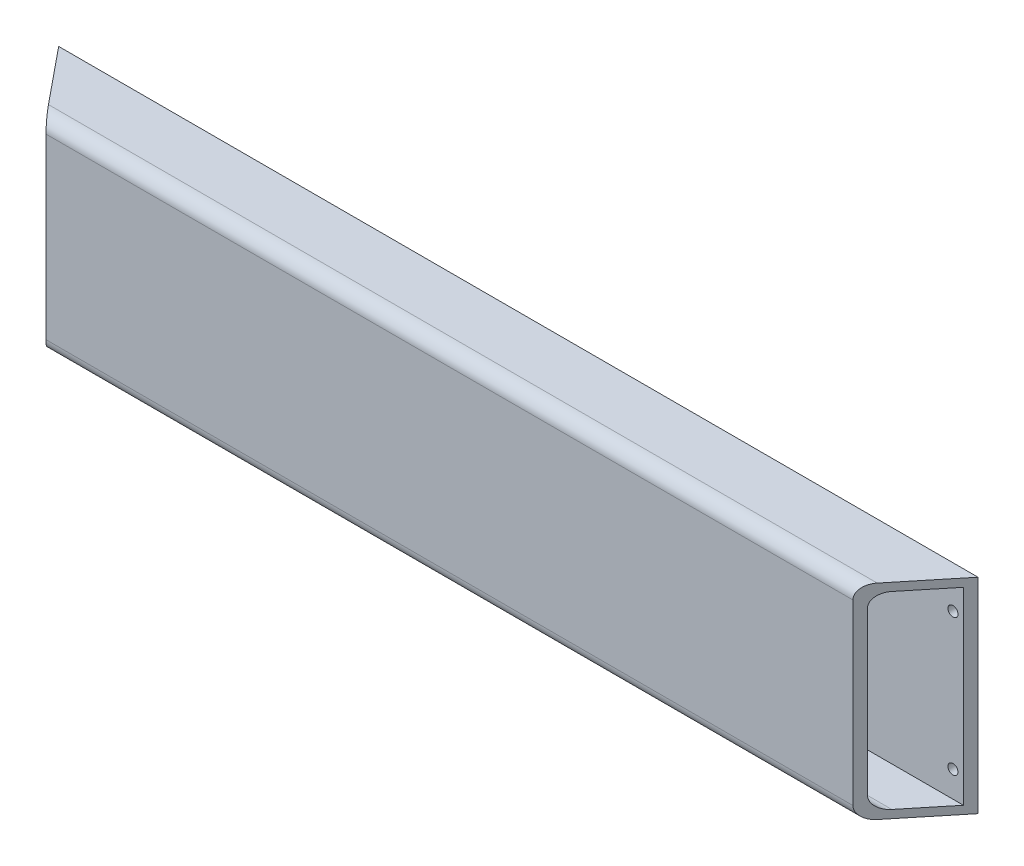
ISO-10303-21;
HEADER;
FILE_DESCRIPTION(('STEP AP214'),'2;1');
FILE_NAME('part.step','',(''),(''),'','','');
FILE_SCHEMA(('AUTOMOTIVE_DESIGN { 1 0 10303 214 1 1 1 1 }'));
ENDSEC;
DATA;
#1=APPLICATION_CONTEXT('core data for automotive mechanical design processes');
#2=APPLICATION_PROTOCOL_DEFINITION('international standard','automotive_design',2000,#1);
#3=PRODUCT_CONTEXT('',#1,'mechanical');
#4=PRODUCT('Part','Part','',(#3));
#5=PRODUCT_RELATED_PRODUCT_CATEGORY('part','',(#4));
#6=PRODUCT_DEFINITION_FORMATION('','',#4);
#7=PRODUCT_DEFINITION_CONTEXT('part definition',#1,'design');
#8=PRODUCT_DEFINITION('design','',#6,#7);
#9=PRODUCT_DEFINITION_SHAPE('','',#8);
#10=(LENGTH_UNIT() NAMED_UNIT(*) SI_UNIT(.MILLI.,.METRE.));
#11=(NAMED_UNIT(*) PLANE_ANGLE_UNIT() SI_UNIT($,.RADIAN.));
#12=(NAMED_UNIT(*) SI_UNIT($,.STERADIAN.) SOLID_ANGLE_UNIT());
#13=UNCERTAINTY_MEASURE_WITH_UNIT(LENGTH_MEASURE(1.E-05),#10,'distance_accuracy_value','');
#14=(GEOMETRIC_REPRESENTATION_CONTEXT(3) GLOBAL_UNCERTAINTY_ASSIGNED_CONTEXT((#13)) GLOBAL_UNIT_ASSIGNED_CONTEXT((#10,
#11,#12)) REPRESENTATION_CONTEXT('',''));
#15=CARTESIAN_POINT('',(0.,0.,0.));
#16=DIRECTION('',(0.,0.,1.));
#17=DIRECTION('',(1.,0.,0.));
#18=AXIS2_PLACEMENT_3D('',#15,#16,#17);
#19=CARTESIAN_POINT('',(0.,442.835896575332,0.));
#20=DIRECTION('',(0.774721400889097,0.,-0.632302736831366));
#21=DIRECTION('',(-0.632302736831366,0.,-0.774721400889097));
#22=AXIS2_PLACEMENT_3D('',#19,#20,#21);
#23=PLANE('',#22);
#24=DIRECTION('',(0.632302736831365,0.,0.774721400889097));
#25=VECTOR('',#24,1.);
#26=CARTESIAN_POINT('',(0.,0.,0.));
#27=LINE('',#26,#25);
#28=CARTESIAN_POINT('',(0.,0.,0.));
#29=VERTEX_POINT('',#28);
#30=CARTESIAN_POINT('',(33.8383210260396,0.,41.46));
#31=VERTEX_POINT('',#30);
#32=EDGE_CURVE('E166',#29,#31,#27,.T.);
#33=ORIENTED_EDGE('',*,*,#32,.T.);
#34=CARTESIAN_POINT('',(33.8383210260396,10.,41.46));
#35=DIRECTION('',(0.774721400889097,0.,-0.632302736831366));
#36=DIRECTION('',(0.632302736831366,0.,0.774721400889097));
#37=AXIS2_PLACEMENT_3D('',#34,#35,#36);
#38=ELLIPSE('',#37,12.9078659612651,10.);
#39=CARTESIAN_POINT('',(42.,10.,51.46));
#40=VERTEX_POINT('',#39);
#41=EDGE_CURVE('E202',#31,#40,#38,.F.);
#42=ORIENTED_EDGE('',*,*,#41,.T.);
#43=DIRECTION('',(0.,-1.,0.));
#44=VECTOR('',#43,1.);
#45=CARTESIAN_POINT('',(42.,442.835896575332,51.46));
#46=LINE('',#45,#44);
#47=CARTESIAN_POINT('',(42.,143.,51.46));
#48=VERTEX_POINT('',#47);
#49=EDGE_CURVE('E173',#48,#40,#46,.T.);
#50=ORIENTED_EDGE('',*,*,#49,.F.);
#51=CARTESIAN_POINT('',(33.8383210260396,143.,41.46));
#52=DIRECTION('',(0.774721400889097,0.,-0.632302736831366));
#53=DIRECTION('',(-0.632302736831366,0.,-0.774721400889097));
#54=AXIS2_PLACEMENT_3D('',#51,#52,#53);
#55=ELLIPSE('',#54,12.9078659612651,10.);
#56=CARTESIAN_POINT('',(33.8383210260396,153.,41.46));
#57=VERTEX_POINT('',#56);
#58=EDGE_CURVE('E200',#48,#57,#55,.F.);
#59=ORIENTED_EDGE('',*,*,#58,.T.);
#60=DIRECTION('',(-0.632302736831366,0.,-0.774721400889097));
#61=VECTOR('',#60,1.);
#62=CARTESIAN_POINT('',(0.,153.,0.));
#63=LINE('',#62,#61);
#64=CARTESIAN_POINT('',(0.,153.,0.));
#65=VERTEX_POINT('',#64);
#66=EDGE_CURVE('E176',#57,#65,#63,.T.);
#67=ORIENTED_EDGE('',*,*,#66,.T.);
#68=DIRECTION('',(0.,-1.,0.));
#69=VECTOR('',#68,1.);
#70=CARTESIAN_POINT('',(0.,0.,0.));
#71=LINE('',#70,#69);
#72=EDGE_CURVE('E178',#65,#29,#71,.T.);
#73=ORIENTED_EDGE('',*,*,#72,.T.);
#74=EDGE_LOOP('',(#33,#42,#50,#59,#67,#73));
#75=FACE_BOUND('',#74,.T.);
#76=DIRECTION('',(-0.632302736831366,0.,-0.774721400889097));
#77=VECTOR('',#76,1.);
#78=CARTESIAN_POINT('',(0.,147.,0.));
#79=LINE('',#78,#77);
#80=CARTESIAN_POINT('',(28.9413136416634,147.,35.46));
#81=VERTEX_POINT('',#80);
#82=CARTESIAN_POINT('',(4.89700738437621,147.,6.));
#83=VERTEX_POINT('',#82);
#84=EDGE_CURVE('E144',#81,#83,#79,.T.);
#85=ORIENTED_EDGE('',*,*,#84,.F.);
#86=CARTESIAN_POINT('',(28.9413136416634,137.,35.46));
#87=DIRECTION('',(0.774721400889097,0.,-0.632302736831366));
#88=DIRECTION('',(0.632302736831366,0.,0.774721400889097));
#89=AXIS2_PLACEMENT_3D('',#86,#87,#88);
#90=ELLIPSE('',#89,12.9078659612651,10.);
#91=CARTESIAN_POINT('',(37.1029926156238,137.,45.46));
#92=VERTEX_POINT('',#91);
#93=EDGE_CURVE('E42',#81,#92,#90,.T.);
#94=ORIENTED_EDGE('',*,*,#93,.T.);
#95=DIRECTION('',(0.,-1.,0.));
#96=VECTOR('',#95,1.);
#97=CARTESIAN_POINT('',(37.1029926156238,0.,45.46));
#98=LINE('',#97,#96);
#99=CARTESIAN_POINT('',(37.1029926156238,16.,45.46));
#100=VERTEX_POINT('',#99);
#101=EDGE_CURVE('E153',#92,#100,#98,.T.);
#102=ORIENTED_EDGE('',*,*,#101,.T.);
#103=CARTESIAN_POINT('',(28.9413136416634,16.,35.46));
#104=DIRECTION('',(0.774721400889097,0.,-0.632302736831366));
#105=DIRECTION('',(-0.632302736831366,0.,-0.774721400889097));
#106=AXIS2_PLACEMENT_3D('',#103,#104,#105);
#107=ELLIPSE('',#106,12.9078659612651,10.);
#108=CARTESIAN_POINT('',(28.9413136416634,6.00000000000001,35.46));
#109=VERTEX_POINT('',#108);
#110=EDGE_CURVE('E49',#100,#109,#107,.T.);
#111=ORIENTED_EDGE('',*,*,#110,.T.);
#112=DIRECTION('',(0.632302736831366,0.,0.774721400889097));
#113=VECTOR('',#112,1.);
#114=CARTESIAN_POINT('',(0.,6.00000000000001,0.));
#115=LINE('',#114,#113);
#116=CARTESIAN_POINT('',(4.89700738437621,6.,6.));
#117=VERTEX_POINT('',#116);
#118=EDGE_CURVE('E150',#117,#109,#115,.T.);
#119=ORIENTED_EDGE('',*,*,#118,.F.);
#120=DIRECTION('',(0.,-1.,0.));
#121=VECTOR('',#120,1.);
#122=CARTESIAN_POINT('',(4.89700738437621,0.,6.));
#123=LINE('',#122,#121);
#124=EDGE_CURVE('E161',#83,#117,#123,.T.);
#125=ORIENTED_EDGE('',*,*,#124,.F.);
#126=EDGE_LOOP('',(#85,#94,#102,#111,#119,#125));
#127=FACE_BOUND('',#126,.T.);
#128=ADVANCED_FACE('F34',(#75,#127),#23,.F.);
#129=CARTESIAN_POINT('',(686.81,442.835896575332,0.));
#130=DIRECTION('',(-0.774721400889097,0.,-0.632302736831366));
#131=DIRECTION('',(-0.632302736831366,0.,0.774721400889097));
#132=AXIS2_PLACEMENT_3D('',#129,#130,#131);
#133=PLANE('',#132);
#134=DIRECTION('',(0.,-1.,0.));
#135=VECTOR('',#134,1.);
#136=CARTESIAN_POINT('',(644.81,442.835896575332,51.46));
#137=LINE('',#136,#135);
#138=CARTESIAN_POINT('',(644.81,143.,51.46));
#139=VERTEX_POINT('',#138);
#140=CARTESIAN_POINT('',(644.81,10.,51.46));
#141=VERTEX_POINT('',#140);
#142=EDGE_CURVE('E167',#139,#141,#137,.T.);
#143=ORIENTED_EDGE('',*,*,#142,.T.);
#144=CARTESIAN_POINT('',(652.97167897396,10.,41.46));
#145=DIRECTION('',(-0.774721400889097,0.,-0.632302736831366));
#146=DIRECTION('',(0.632302736831366,0.,-0.774721400889097));
#147=AXIS2_PLACEMENT_3D('',#144,#145,#146);
#148=ELLIPSE('',#147,12.9078659612651,10.);
#149=CARTESIAN_POINT('',(652.97167897396,0.,41.46));
#150=VERTEX_POINT('',#149);
#151=EDGE_CURVE('E196',#141,#150,#148,.F.);
#152=ORIENTED_EDGE('',*,*,#151,.T.);
#153=DIRECTION('',(0.632302736831366,0.,-0.774721400889097));
#154=VECTOR('',#153,1.);
#155=CARTESIAN_POINT('',(686.81,0.,0.));
#156=LINE('',#155,#154);
#157=CARTESIAN_POINT('',(686.81,0.,0.));
#158=VERTEX_POINT('',#157);
#159=EDGE_CURVE('E145',#150,#158,#156,.T.);
#160=ORIENTED_EDGE('',*,*,#159,.T.);
#161=DIRECTION('',(0.,1.,0.));
#162=VECTOR('',#161,1.);
#163=CARTESIAN_POINT('',(686.81,0.,0.));
#164=LINE('',#163,#162);
#165=CARTESIAN_POINT('',(686.81,153.,0.));
#166=VERTEX_POINT('',#165);
#167=EDGE_CURVE('E183',#158,#166,#164,.T.);
#168=ORIENTED_EDGE('',*,*,#167,.T.);
#169=DIRECTION('',(-0.632302736831366,0.,0.774721400889097));
#170=VECTOR('',#169,1.);
#171=CARTESIAN_POINT('',(686.81,153.,0.));
#172=LINE('',#171,#170);
#173=CARTESIAN_POINT('',(652.97167897396,153.,41.46));
#174=VERTEX_POINT('',#173);
#175=EDGE_CURVE('E163',#166,#174,#172,.T.);
#176=ORIENTED_EDGE('',*,*,#175,.T.);
#177=CARTESIAN_POINT('',(652.97167897396,143.,41.46));
#178=DIRECTION('',(-0.774721400889097,0.,-0.632302736831366));
#179=DIRECTION('',(-0.632302736831366,0.,0.774721400889097));
#180=AXIS2_PLACEMENT_3D('',#177,#178,#179);
#181=ELLIPSE('',#180,12.9078659612651,10.);
#182=EDGE_CURVE('E194',#174,#139,#181,.F.);
#183=ORIENTED_EDGE('',*,*,#182,.T.);
#184=EDGE_LOOP('',(#143,#152,#160,#168,#176,#183));
#185=FACE_BOUND('',#184,.T.);
#186=DIRECTION('',(-0.632302736831366,0.,0.774721400889097));
#187=VECTOR('',#186,1.);
#188=CARTESIAN_POINT('',(686.81,147.,0.));
#189=LINE('',#188,#187);
#190=CARTESIAN_POINT('',(681.912992615624,147.,6.));
#191=VERTEX_POINT('',#190);
#192=CARTESIAN_POINT('',(657.868686358337,147.,35.46));
#193=VERTEX_POINT('',#192);
#194=EDGE_CURVE('E141',#191,#193,#189,.T.);
#195=ORIENTED_EDGE('',*,*,#194,.F.);
#196=DIRECTION('',(0.,1.,0.));
#197=VECTOR('',#196,1.);
#198=CARTESIAN_POINT('',(681.912992615624,0.,6.));
#199=LINE('',#198,#197);
#200=CARTESIAN_POINT('',(681.912992615624,6.,6.));
#201=VERTEX_POINT('',#200);
#202=EDGE_CURVE('E126',#201,#191,#199,.T.);
#203=ORIENTED_EDGE('',*,*,#202,.F.);
#204=DIRECTION('',(0.632302736831366,0.,-0.774721400889097));
#205=VECTOR('',#204,1.);
#206=CARTESIAN_POINT('',(686.81,6.00000000000001,0.));
#207=LINE('',#206,#205);
#208=CARTESIAN_POINT('',(657.868686358337,6.00000000000001,35.46));
#209=VERTEX_POINT('',#208);
#210=EDGE_CURVE('E155',#209,#201,#207,.T.);
#211=ORIENTED_EDGE('',*,*,#210,.F.);
#212=CARTESIAN_POINT('',(657.868686358336,16.,35.46));
#213=DIRECTION('',(-0.774721400889097,0.,-0.632302736831366));
#214=DIRECTION('',(-0.632302736831366,0.,0.774721400889097));
#215=AXIS2_PLACEMENT_3D('',#212,#213,#214);
#216=ELLIPSE('',#215,12.9078659612651,10.);
#217=CARTESIAN_POINT('',(649.707007384376,16.,45.46));
#218=VERTEX_POINT('',#217);
#219=EDGE_CURVE('E214',#209,#218,#216,.T.);
#220=ORIENTED_EDGE('',*,*,#219,.T.);
#221=DIRECTION('',(0.,-1.,0.));
#222=VECTOR('',#221,1.);
#223=CARTESIAN_POINT('',(649.707007384376,442.835896575332,45.46));
#224=LINE('',#223,#222);
#225=CARTESIAN_POINT('',(649.707007384376,137.,45.46));
#226=VERTEX_POINT('',#225);
#227=EDGE_CURVE('E151',#226,#218,#224,.T.);
#228=ORIENTED_EDGE('',*,*,#227,.F.);
#229=CARTESIAN_POINT('',(657.868686358336,137.,35.46));
#230=DIRECTION('',(-0.774721400889097,0.,-0.632302736831366));
#231=DIRECTION('',(0.632302736831366,0.,-0.774721400889097));
#232=AXIS2_PLACEMENT_3D('',#229,#230,#231);
#233=ELLIPSE('',#232,12.9078659612651,10.);
#234=EDGE_CURVE('E11',#226,#193,#233,.T.);
#235=ORIENTED_EDGE('',*,*,#234,.T.);
#236=EDGE_LOOP('',(#195,#203,#211,#220,#228,#235));
#237=FACE_BOUND('',#236,.T.);
#238=ADVANCED_FACE('F147',(#185,#237),#133,.F.);
#239=CARTESIAN_POINT('',(0.,0.,51.46));
#240=DIRECTION('',(0.,1.,0.));
#241=DIRECTION('',(0.,0.,1.));
#242=AXIS2_PLACEMENT_3D('',#239,#240,#241);
#243=PLANE('',#242);
#244=ORIENTED_EDGE('',*,*,#159,.F.);
#245=DIRECTION('',(1.,0.,0.));
#246=VECTOR('',#245,1.);
#247=CARTESIAN_POINT('',(0.,0.,41.46));
#248=LINE('',#247,#246);
#249=EDGE_CURVE('E198',#150,#31,#248,.F.);
#250=ORIENTED_EDGE('',*,*,#249,.T.);
#251=ORIENTED_EDGE('',*,*,#32,.F.);
#252=DIRECTION('',(1.,0.,0.));
#253=VECTOR('',#252,1.);
#254=CARTESIAN_POINT('',(0.,0.,0.));
#255=LINE('',#254,#253);
#256=EDGE_CURVE('E180',#29,#158,#255,.T.);
#257=ORIENTED_EDGE('',*,*,#256,.T.);
#258=EDGE_LOOP('',(#244,#250,#251,#257));
#259=FACE_BOUND('',#258,.T.);
#260=ADVANCED_FACE('F232',(#259),#243,.F.);
#261=CARTESIAN_POINT('',(0.,153.,51.46));
#262=DIRECTION('',(0.,-1.,0.));
#263=DIRECTION('',(0.,0.,-1.));
#264=AXIS2_PLACEMENT_3D('',#261,#262,#263);
#265=PLANE('',#264);
#266=ORIENTED_EDGE('',*,*,#66,.F.);
#267=DIRECTION('',(-1.,0.,0.));
#268=VECTOR('',#267,1.);
#269=CARTESIAN_POINT('',(0.,153.,41.46));
#270=LINE('',#269,#268);
#271=EDGE_CURVE('E204',#57,#174,#270,.F.);
#272=ORIENTED_EDGE('',*,*,#271,.T.);
#273=ORIENTED_EDGE('',*,*,#175,.F.);
#274=DIRECTION('',(-1.,0.,0.));
#275=VECTOR('',#274,1.);
#276=CARTESIAN_POINT('',(0.,153.,0.));
#277=LINE('',#276,#275);
#278=EDGE_CURVE('E185',#166,#65,#277,.T.);
#279=ORIENTED_EDGE('',*,*,#278,.T.);
#280=EDGE_LOOP('',(#266,#272,#273,#279));
#281=FACE_BOUND('',#280,.T.);
#282=ADVANCED_FACE('F241',(#281),#265,.F.);
#283=CARTESIAN_POINT('',(0.,0.,51.46));
#284=DIRECTION('',(0.,0.,-1.));
#285=DIRECTION('',(-1.,0.,0.));
#286=AXIS2_PLACEMENT_3D('',#283,#284,#285);
#287=PLANE('',#286);
#288=ORIENTED_EDGE('',*,*,#49,.T.);
#289=DIRECTION('',(1.,0.,0.));
#290=VECTOR('',#289,1.);
#291=CARTESIAN_POINT('',(0.,10.,51.46));
#292=LINE('',#291,#290);
#293=EDGE_CURVE('E191',#40,#141,#292,.T.);
#294=ORIENTED_EDGE('',*,*,#293,.T.);
#295=ORIENTED_EDGE('',*,*,#142,.F.);
#296=DIRECTION('',(-1.,0.,0.));
#297=VECTOR('',#296,1.);
#298=CARTESIAN_POINT('',(0.,143.,51.46));
#299=LINE('',#298,#297);
#300=EDGE_CURVE('E188',#139,#48,#299,.T.);
#301=ORIENTED_EDGE('',*,*,#300,.T.);
#302=EDGE_LOOP('',(#288,#294,#295,#301));
#303=FACE_BOUND('',#302,.T.);
#304=ADVANCED_FACE('F237',(#303),#287,.F.);
#305=CARTESIAN_POINT('',(0.,0.,0.));
#306=DIRECTION('',(0.,0.,-1.));
#307=DIRECTION('',(-1.,0.,0.));
#308=AXIS2_PLACEMENT_3D('',#305,#306,#307);
#309=PLANE('',#308);
#310=CARTESIAN_POINT('',(12.7,127.6,0.));
#311=DIRECTION('',(0.,0.,-1.));
#312=DIRECTION('',(-1.,0.,0.));
#313=AXIS2_PLACEMENT_3D('',#310,#311,#312);
#314=CIRCLE('',#313,3.75);
#315=CARTESIAN_POINT('',(8.95,127.6,0.));
#316=VERTEX_POINT('',#315);
#317=EDGE_CURVE('E414',#316,#316,#314,.F.);
#318=ORIENTED_EDGE('',*,*,#317,.T.);
#319=EDGE_LOOP('',(#318));
#320=FACE_BOUND('',#319,.T.);
#321=CARTESIAN_POINT('',(674.11,25.4,0.));
#322=DIRECTION('',(0.,0.,-1.));
#323=DIRECTION('',(-1.,0.,0.));
#324=AXIS2_PLACEMENT_3D('',#321,#322,#323);
#325=CIRCLE('',#324,3.74999999999998);
#326=CARTESIAN_POINT('',(670.36,25.4,0.));
#327=VERTEX_POINT('',#326);
#328=EDGE_CURVE('E422',#327,#327,#325,.F.);
#329=ORIENTED_EDGE('',*,*,#328,.T.);
#330=EDGE_LOOP('',(#329));
#331=FACE_BOUND('',#330,.T.);
#332=CARTESIAN_POINT('',(674.11,127.6,0.));
#333=DIRECTION('',(0.,0.,-1.));
#334=DIRECTION('',(-1.,0.,0.));
#335=AXIS2_PLACEMENT_3D('',#332,#333,#334);
#336=CIRCLE('',#335,3.74999999999998);
#337=CARTESIAN_POINT('',(670.36,127.6,0.));
#338=VERTEX_POINT('',#337);
#339=EDGE_CURVE('E415',#338,#338,#336,.F.);
#340=ORIENTED_EDGE('',*,*,#339,.T.);
#341=EDGE_LOOP('',(#340));
#342=FACE_BOUND('',#341,.T.);
#343=CARTESIAN_POINT('',(12.7,25.4,0.));
#344=DIRECTION('',(0.,0.,-1.));
#345=DIRECTION('',(-1.,0.,0.));
#346=AXIS2_PLACEMENT_3D('',#343,#344,#345);
#347=CIRCLE('',#346,3.75);
#348=CARTESIAN_POINT('',(8.95,25.4,0.));
#349=VERTEX_POINT('',#348);
#350=EDGE_CURVE('E406',#349,#349,#347,.F.);
#351=ORIENTED_EDGE('',*,*,#350,.T.);
#352=EDGE_LOOP('',(#351));
#353=FACE_BOUND('',#352,.T.);
#354=ORIENTED_EDGE('',*,*,#72,.F.);
#355=ORIENTED_EDGE('',*,*,#278,.F.);
#356=ORIENTED_EDGE('',*,*,#167,.F.);
#357=ORIENTED_EDGE('',*,*,#256,.F.);
#358=EDGE_LOOP('',(#354,#355,#356,#357));
#359=FACE_BOUND('',#358,.T.);
#360=ADVANCED_FACE('F240',(#320,#331,#342,#353,#359),#309,.T.);
#361=CARTESIAN_POINT('',(0.,6.,51.46));
#362=DIRECTION('',(0.,1.,0.));
#363=DIRECTION('',(0.,0.,1.));
#364=AXIS2_PLACEMENT_3D('',#361,#362,#363);
#365=PLANE('',#364);
#366=ORIENTED_EDGE('',*,*,#118,.T.);
#367=DIRECTION('',(1.,0.,0.));
#368=VECTOR('',#367,1.);
#369=CARTESIAN_POINT('',(649.707007384376,6.,35.46));
#370=LINE('',#369,#368);
#371=EDGE_CURVE('E206',#109,#209,#370,.T.);
#372=ORIENTED_EDGE('',*,*,#371,.T.);
#373=ORIENTED_EDGE('',*,*,#210,.T.);
#374=DIRECTION('',(1.,0.,0.));
#375=VECTOR('',#374,1.);
#376=CARTESIAN_POINT('',(0.,6.,6.));
#377=LINE('',#376,#375);
#378=EDGE_CURVE('E132',#117,#201,#377,.T.);
#379=ORIENTED_EDGE('',*,*,#378,.F.);
#380=EDGE_LOOP('',(#366,#372,#373,#379));
#381=FACE_BOUND('',#380,.T.);
#382=ADVANCED_FACE('F245',(#381),#365,.T.);
#383=CARTESIAN_POINT('',(0.,147.,51.46));
#384=DIRECTION('',(0.,-1.,0.));
#385=DIRECTION('',(0.,0.,-1.));
#386=AXIS2_PLACEMENT_3D('',#383,#384,#385);
#387=PLANE('',#386);
#388=ORIENTED_EDGE('',*,*,#194,.T.);
#389=DIRECTION('',(-1.,0.,0.));
#390=VECTOR('',#389,1.);
#391=CARTESIAN_POINT('',(37.1029926156238,147.,35.46));
#392=LINE('',#391,#390);
#393=EDGE_CURVE('E212',#193,#81,#392,.T.);
#394=ORIENTED_EDGE('',*,*,#393,.T.);
#395=ORIENTED_EDGE('',*,*,#84,.T.);
#396=DIRECTION('',(-1.,0.,0.));
#397=VECTOR('',#396,1.);
#398=CARTESIAN_POINT('',(0.,147.,6.));
#399=LINE('',#398,#397);
#400=EDGE_CURVE('E129',#191,#83,#399,.T.);
#401=ORIENTED_EDGE('',*,*,#400,.F.);
#402=EDGE_LOOP('',(#388,#394,#395,#401));
#403=FACE_BOUND('',#402,.T.);
#404=ADVANCED_FACE('F139',(#403),#387,.T.);
#405=CARTESIAN_POINT('',(0.,0.,45.46));
#406=DIRECTION('',(0.,0.,-1.));
#407=DIRECTION('',(-1.,0.,0.));
#408=AXIS2_PLACEMENT_3D('',#405,#406,#407);
#409=PLANE('',#408);
#410=ORIENTED_EDGE('',*,*,#227,.T.);
#411=DIRECTION('',(1.,0.,0.));
#412=VECTOR('',#411,1.);
#413=CARTESIAN_POINT('',(37.1029926156238,16.,45.46));
#414=LINE('',#413,#412);
#415=EDGE_CURVE('E57',#218,#100,#414,.F.);
#416=ORIENTED_EDGE('',*,*,#415,.T.);
#417=ORIENTED_EDGE('',*,*,#101,.F.);
#418=DIRECTION('',(-1.,0.,0.));
#419=VECTOR('',#418,1.);
#420=CARTESIAN_POINT('',(649.707007384376,137.,45.46));
#421=LINE('',#420,#419);
#422=EDGE_CURVE('E209',#92,#226,#421,.F.);
#423=ORIENTED_EDGE('',*,*,#422,.T.);
#424=EDGE_LOOP('',(#410,#416,#417,#423));
#425=FACE_BOUND('',#424,.T.);
#426=ADVANCED_FACE('F218',(#425),#409,.T.);
#427=CARTESIAN_POINT('',(0.,0.,6.));
#428=DIRECTION('',(0.,0.,-1.));
#429=DIRECTION('',(-1.,0.,0.));
#430=AXIS2_PLACEMENT_3D('',#427,#428,#429);
#431=PLANE('',#430);
#432=CARTESIAN_POINT('',(12.7,127.6,6.));
#433=DIRECTION('',(0.,0.,1.));
#434=DIRECTION('',(1.,0.,0.));
#435=AXIS2_PLACEMENT_3D('',#432,#433,#434);
#436=CIRCLE('',#435,3.75);
#437=CARTESIAN_POINT('',(16.45,127.6,6.));
#438=VERTEX_POINT('',#437);
#439=EDGE_CURVE('E425',#438,#438,#436,.T.);
#440=ORIENTED_EDGE('',*,*,#439,.F.);
#441=EDGE_LOOP('',(#440));
#442=FACE_BOUND('',#441,.T.);
#443=CARTESIAN_POINT('',(674.11,25.4,6.));
#444=DIRECTION('',(0.,0.,1.));
#445=DIRECTION('',(1.,0.,0.));
#446=AXIS2_PLACEMENT_3D('',#443,#444,#445);
#447=CIRCLE('',#446,3.74999999999998);
#448=CARTESIAN_POINT('',(677.86,25.4,6.));
#449=VERTEX_POINT('',#448);
#450=EDGE_CURVE('E418',#449,#449,#447,.T.);
#451=ORIENTED_EDGE('',*,*,#450,.F.);
#452=EDGE_LOOP('',(#451));
#453=FACE_BOUND('',#452,.T.);
#454=CARTESIAN_POINT('',(674.11,127.6,6.));
#455=DIRECTION('',(0.,0.,1.));
#456=DIRECTION('',(1.,0.,0.));
#457=AXIS2_PLACEMENT_3D('',#454,#455,#456);
#458=CIRCLE('',#457,3.74999999999998);
#459=CARTESIAN_POINT('',(677.86,127.6,6.));
#460=VERTEX_POINT('',#459);
#461=EDGE_CURVE('E419',#460,#460,#458,.T.);
#462=ORIENTED_EDGE('',*,*,#461,.F.);
#463=EDGE_LOOP('',(#462));
#464=FACE_BOUND('',#463,.T.);
#465=CARTESIAN_POINT('',(12.7,25.4,6.));
#466=DIRECTION('',(0.,0.,1.));
#467=DIRECTION('',(1.,0.,0.));
#468=AXIS2_PLACEMENT_3D('',#465,#466,#467);
#469=CIRCLE('',#468,3.75);
#470=CARTESIAN_POINT('',(16.45,25.4,6.));
#471=VERTEX_POINT('',#470);
#472=EDGE_CURVE('E408',#471,#471,#469,.T.);
#473=ORIENTED_EDGE('',*,*,#472,.F.);
#474=EDGE_LOOP('',(#473));
#475=FACE_BOUND('',#474,.T.);
#476=ORIENTED_EDGE('',*,*,#124,.T.);
#477=ORIENTED_EDGE('',*,*,#378,.T.);
#478=ORIENTED_EDGE('',*,*,#202,.T.);
#479=ORIENTED_EDGE('',*,*,#400,.T.);
#480=EDGE_LOOP('',(#476,#477,#478,#479));
#481=FACE_BOUND('',#480,.T.);
#482=ADVANCED_FACE('F128',(#442,#453,#464,#475,#481),#431,.F.);
#483=CARTESIAN_POINT('',(12.7,25.4,-10.6066017177982));
#484=DIRECTION('',(0.,0.,1.));
#485=DIRECTION('',(1.,0.,0.));
#486=AXIS2_PLACEMENT_3D('',#483,#484,#485);
#487=CYLINDRICAL_SURFACE('',#486,3.75);
#488=ORIENTED_EDGE('',*,*,#472,.T.);
#489=EDGE_LOOP('',(#488));
#490=FACE_BOUND('',#489,.T.);
#491=ORIENTED_EDGE('',*,*,#350,.F.);
#492=EDGE_LOOP('',(#491));
#493=FACE_BOUND('',#492,.T.);
#494=ADVANCED_FACE('F324',(#490,#493),#487,.F.);
#495=CARTESIAN_POINT('',(674.11,127.6,-10.6066017177982));
#496=DIRECTION('',(0.,0.,1.));
#497=DIRECTION('',(1.,0.,0.));
#498=AXIS2_PLACEMENT_3D('',#495,#496,#497);
#499=CYLINDRICAL_SURFACE('',#498,3.74999999999998);
#500=ORIENTED_EDGE('',*,*,#461,.T.);
#501=EDGE_LOOP('',(#500));
#502=FACE_BOUND('',#501,.T.);
#503=ORIENTED_EDGE('',*,*,#339,.F.);
#504=EDGE_LOOP('',(#503));
#505=FACE_BOUND('',#504,.T.);
#506=ADVANCED_FACE('F315',(#502,#505),#499,.F.);
#507=CARTESIAN_POINT('',(674.11,25.4,-10.6066017177982));
#508=DIRECTION('',(0.,0.,1.));
#509=DIRECTION('',(1.,0.,0.));
#510=AXIS2_PLACEMENT_3D('',#507,#508,#509);
#511=CYLINDRICAL_SURFACE('',#510,3.74999999999998);
#512=ORIENTED_EDGE('',*,*,#450,.T.);
#513=EDGE_LOOP('',(#512));
#514=FACE_BOUND('',#513,.T.);
#515=ORIENTED_EDGE('',*,*,#328,.F.);
#516=EDGE_LOOP('',(#515));
#517=FACE_BOUND('',#516,.T.);
#518=ADVANCED_FACE('F306',(#514,#517),#511,.F.);
#519=CARTESIAN_POINT('',(12.7,127.6,-10.6066017177982));
#520=DIRECTION('',(0.,0.,1.));
#521=DIRECTION('',(1.,0.,0.));
#522=AXIS2_PLACEMENT_3D('',#519,#520,#521);
#523=CYLINDRICAL_SURFACE('',#522,3.75);
#524=ORIENTED_EDGE('',*,*,#439,.T.);
#525=EDGE_LOOP('',(#524));
#526=FACE_BOUND('',#525,.T.);
#527=ORIENTED_EDGE('',*,*,#317,.F.);
#528=EDGE_LOOP('',(#527));
#529=FACE_BOUND('',#528,.T.);
#530=ADVANCED_FACE('F256',(#526,#529),#523,.F.);
#531=CARTESIAN_POINT('',(0.,10.,41.46));
#532=DIRECTION('',(1.,0.,0.));
#533=DIRECTION('',(0.,0.,-1.));
#534=AXIS2_PLACEMENT_3D('',#531,#532,#533);
#535=CYLINDRICAL_SURFACE('',#534,10.);
#536=ORIENTED_EDGE('',*,*,#41,.F.);
#537=ORIENTED_EDGE('',*,*,#249,.F.);
#538=ORIENTED_EDGE('',*,*,#151,.F.);
#539=ORIENTED_EDGE('',*,*,#293,.F.);
#540=EDGE_LOOP('',(#536,#537,#538,#539));
#541=FACE_BOUND('',#540,.T.);
#542=ADVANCED_FACE('F253',(#541),#535,.T.);
#543=CARTESIAN_POINT('',(0.,143.,41.46));
#544=DIRECTION('',(-1.,0.,0.));
#545=DIRECTION('',(0.,0.,1.));
#546=AXIS2_PLACEMENT_3D('',#543,#544,#545);
#547=CYLINDRICAL_SURFACE('',#546,10.);
#548=ORIENTED_EDGE('',*,*,#182,.F.);
#549=ORIENTED_EDGE('',*,*,#271,.F.);
#550=ORIENTED_EDGE('',*,*,#58,.F.);
#551=ORIENTED_EDGE('',*,*,#300,.F.);
#552=EDGE_LOOP('',(#548,#549,#550,#551));
#553=FACE_BOUND('',#552,.T.);
#554=ADVANCED_FACE('F224',(#553),#547,.T.);
#555=CARTESIAN_POINT('',(0.,16.,35.46));
#556=DIRECTION('',(-1.,0.,0.));
#557=DIRECTION('',(0.,0.,1.));
#558=AXIS2_PLACEMENT_3D('',#555,#556,#557);
#559=CYLINDRICAL_SURFACE('',#558,10.);
#560=ORIENTED_EDGE('',*,*,#110,.F.);
#561=ORIENTED_EDGE('',*,*,#415,.F.);
#562=ORIENTED_EDGE('',*,*,#219,.F.);
#563=ORIENTED_EDGE('',*,*,#371,.F.);
#564=EDGE_LOOP('',(#560,#561,#562,#563));
#565=FACE_BOUND('',#564,.T.);
#566=ADVANCED_FACE('F220',(#565),#559,.F.);
#567=CARTESIAN_POINT('',(0.,137.,35.46));
#568=DIRECTION('',(1.,0.,0.));
#569=DIRECTION('',(0.,0.,-1.));
#570=AXIS2_PLACEMENT_3D('',#567,#568,#569);
#571=CYLINDRICAL_SURFACE('',#570,10.);
#572=ORIENTED_EDGE('',*,*,#234,.F.);
#573=ORIENTED_EDGE('',*,*,#422,.F.);
#574=ORIENTED_EDGE('',*,*,#93,.F.);
#575=ORIENTED_EDGE('',*,*,#393,.F.);
#576=EDGE_LOOP('',(#572,#573,#574,#575));
#577=FACE_BOUND('',#576,.T.);
#578=ADVANCED_FACE('F36',(#577),#571,.F.);
#579=CLOSED_SHELL('',(#128,#238,#260,#282,#304,#360,#382,#404,#426,#482,#494,#506,#518,#530,
#542,#554,#566,#578));
#580=MANIFOLD_SOLID_BREP('B2',#579);
#581=ADVANCED_BREP_SHAPE_REPRESENTATION('',(#18,#580),#14);
#582=SHAPE_DEFINITION_REPRESENTATION(#9,#581);
ENDSEC;
END-ISO-10303-21;
